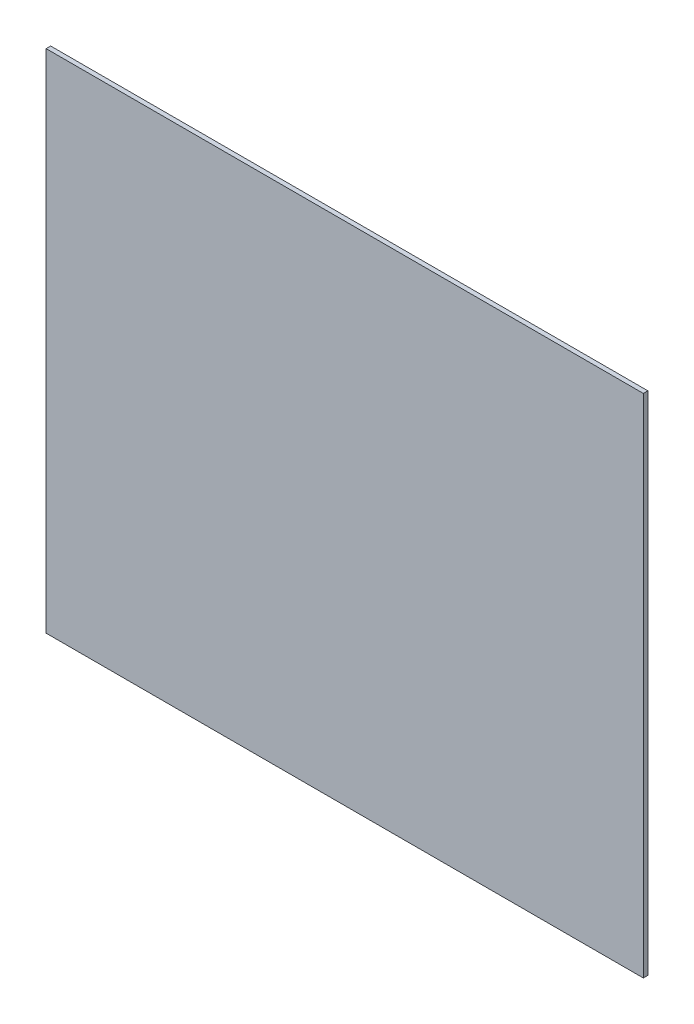
ISO-10303-21;
HEADER;
FILE_DESCRIPTION(('STEP AP214'),'2;1');
FILE_NAME('part.step','',(''),(''),'','','');
FILE_SCHEMA(('AUTOMOTIVE_DESIGN { 1 0 10303 214 1 1 1 1 }'));
ENDSEC;
DATA;
#1=APPLICATION_CONTEXT('core data for automotive mechanical design processes');
#2=APPLICATION_PROTOCOL_DEFINITION('international standard','automotive_design',2000,#1);
#3=PRODUCT_CONTEXT('',#1,'mechanical');
#4=PRODUCT('Part','Part','',(#3));
#5=PRODUCT_RELATED_PRODUCT_CATEGORY('part','',(#4));
#6=PRODUCT_DEFINITION_FORMATION('','',#4);
#7=PRODUCT_DEFINITION_CONTEXT('part definition',#1,'design');
#8=PRODUCT_DEFINITION('design','',#6,#7);
#9=PRODUCT_DEFINITION_SHAPE('','',#8);
#10=(LENGTH_UNIT() NAMED_UNIT(*) SI_UNIT(.MILLI.,.METRE.));
#11=(NAMED_UNIT(*) PLANE_ANGLE_UNIT() SI_UNIT($,.RADIAN.));
#12=(NAMED_UNIT(*) SI_UNIT($,.STERADIAN.) SOLID_ANGLE_UNIT());
#13=UNCERTAINTY_MEASURE_WITH_UNIT(LENGTH_MEASURE(1.E-05),#10,'distance_accuracy_value','');
#14=(GEOMETRIC_REPRESENTATION_CONTEXT(3) GLOBAL_UNCERTAINTY_ASSIGNED_CONTEXT((#13)) GLOBAL_UNIT_ASSIGNED_CONTEXT((#10,
#11,#12)) REPRESENTATION_CONTEXT('',''));
#15=CARTESIAN_POINT('',(0.,0.,0.));
#16=DIRECTION('',(0.,0.,1.));
#17=DIRECTION('',(1.,0.,0.));
#18=AXIS2_PLACEMENT_3D('',#15,#16,#17);
#19=CARTESIAN_POINT('',(197.,167.,0.));
#20=DIRECTION('',(0.,0.,1.));
#21=DIRECTION('',(1.,0.,0.));
#22=AXIS2_PLACEMENT_3D('',#19,#20,#21);
#23=PLANE('',#22);
#24=DIRECTION('',(0.,1.,0.));
#25=VECTOR('',#24,1.);
#26=CARTESIAN_POINT('',(0.,334.,0.));
#27=LINE('',#26,#25);
#28=CARTESIAN_POINT('',(0.,334.,0.));
#29=VERTEX_POINT('',#28);
#30=CARTESIAN_POINT('',(0.,0.,0.));
#31=VERTEX_POINT('',#30);
#32=EDGE_CURVE('E78',#29,#31,#27,.F.);
#33=ORIENTED_EDGE('',*,*,#32,.F.);
#34=DIRECTION('',(1.,0.,0.));
#35=VECTOR('',#34,1.);
#36=CARTESIAN_POINT('',(394.,334.,0.));
#37=LINE('',#36,#35);
#38=CARTESIAN_POINT('',(394.,334.,0.));
#39=VERTEX_POINT('',#38);
#40=EDGE_CURVE('E54',#39,#29,#37,.F.);
#41=ORIENTED_EDGE('',*,*,#40,.F.);
#42=DIRECTION('',(0.,1.,0.));
#43=VECTOR('',#42,1.);
#44=CARTESIAN_POINT('',(394.,0.,0.));
#45=LINE('',#44,#43);
#46=CARTESIAN_POINT('',(394.,0.,0.));
#47=VERTEX_POINT('',#46);
#48=EDGE_CURVE('E56',#47,#39,#45,.T.);
#49=ORIENTED_EDGE('',*,*,#48,.F.);
#50=DIRECTION('',(1.,0.,0.));
#51=VECTOR('',#50,1.);
#52=CARTESIAN_POINT('',(0.,0.,0.));
#53=LINE('',#52,#51);
#54=EDGE_CURVE('E19',#31,#47,#53,.T.);
#55=ORIENTED_EDGE('',*,*,#54,.F.);
#56=EDGE_LOOP('',(#33,#41,#49,#55));
#57=FACE_BOUND('',#56,.T.);
#58=ADVANCED_FACE('F16',(#57),#23,.F.);
#59=CARTESIAN_POINT('',(0.,0.,0.));
#60=DIRECTION('',(0.,-1.,0.));
#61=DIRECTION('',(0.,0.,-1.));
#62=AXIS2_PLACEMENT_3D('',#59,#60,#61);
#63=PLANE('',#62);
#64=DIRECTION('',(1.,0.,0.));
#65=VECTOR('',#64,1.);
#66=CARTESIAN_POINT('',(197.,0.,3.));
#67=LINE('',#66,#65);
#68=CARTESIAN_POINT('',(0.,0.,3.));
#69=VERTEX_POINT('',#68);
#70=CARTESIAN_POINT('',(394.,0.,3.));
#71=VERTEX_POINT('',#70);
#72=EDGE_CURVE('E82',#69,#71,#67,.T.);
#73=ORIENTED_EDGE('',*,*,#72,.F.);
#74=DIRECTION('',(0.,0.,1.));
#75=VECTOR('',#74,1.);
#76=CARTESIAN_POINT('',(0.,0.,0.));
#77=LINE('',#76,#75);
#78=EDGE_CURVE('E67',#31,#69,#77,.T.);
#79=ORIENTED_EDGE('',*,*,#78,.F.);
#80=ORIENTED_EDGE('',*,*,#54,.T.);
#81=DIRECTION('',(0.,0.,-1.));
#82=VECTOR('',#81,1.);
#83=CARTESIAN_POINT('',(394.,0.,0.));
#84=LINE('',#83,#82);
#85=EDGE_CURVE('E62',#71,#47,#84,.T.);
#86=ORIENTED_EDGE('',*,*,#85,.F.);
#87=EDGE_LOOP('',(#73,#79,#80,#86));
#88=FACE_BOUND('',#87,.T.);
#89=ADVANCED_FACE('F64',(#88),#63,.T.);
#90=CARTESIAN_POINT('',(394.,0.,0.));
#91=DIRECTION('',(1.,0.,0.));
#92=DIRECTION('',(0.,0.,-1.));
#93=AXIS2_PLACEMENT_3D('',#90,#91,#92);
#94=PLANE('',#93);
#95=DIRECTION('',(0.,1.,0.));
#96=VECTOR('',#95,1.);
#97=CARTESIAN_POINT('',(394.,167.,3.));
#98=LINE('',#97,#96);
#99=CARTESIAN_POINT('',(394.,334.,3.));
#100=VERTEX_POINT('',#99);
#101=EDGE_CURVE('E71',#71,#100,#98,.T.);
#102=ORIENTED_EDGE('',*,*,#101,.F.);
#103=ORIENTED_EDGE('',*,*,#85,.T.);
#104=ORIENTED_EDGE('',*,*,#48,.T.);
#105=DIRECTION('',(0.,0.,1.));
#106=VECTOR('',#105,1.);
#107=CARTESIAN_POINT('',(394.,334.,0.));
#108=LINE('',#107,#106);
#109=EDGE_CURVE('E74',#100,#39,#108,.F.);
#110=ORIENTED_EDGE('',*,*,#109,.F.);
#111=EDGE_LOOP('',(#102,#103,#104,#110));
#112=FACE_BOUND('',#111,.T.);
#113=ADVANCED_FACE('F69',(#112),#94,.T.);
#114=CARTESIAN_POINT('',(394.,334.,0.));
#115=DIRECTION('',(0.,1.,0.));
#116=DIRECTION('',(0.,0.,1.));
#117=AXIS2_PLACEMENT_3D('',#114,#115,#116);
#118=PLANE('',#117);
#119=DIRECTION('',(1.,0.,0.));
#120=VECTOR('',#119,1.);
#121=CARTESIAN_POINT('',(197.,334.,3.));
#122=LINE('',#121,#120);
#123=CARTESIAN_POINT('',(0.,334.,3.));
#124=VERTEX_POINT('',#123);
#125=EDGE_CURVE('E25',#100,#124,#122,.F.);
#126=ORIENTED_EDGE('',*,*,#125,.F.);
#127=ORIENTED_EDGE('',*,*,#109,.T.);
#128=ORIENTED_EDGE('',*,*,#40,.T.);
#129=DIRECTION('',(0.,0.,1.));
#130=VECTOR('',#129,1.);
#131=CARTESIAN_POINT('',(0.,334.,0.));
#132=LINE('',#131,#130);
#133=EDGE_CURVE('E34',#124,#29,#132,.F.);
#134=ORIENTED_EDGE('',*,*,#133,.F.);
#135=EDGE_LOOP('',(#126,#127,#128,#134));
#136=FACE_BOUND('',#135,.T.);
#137=ADVANCED_FACE('F88',(#136),#118,.T.);
#138=CARTESIAN_POINT('',(0.,334.,0.));
#139=DIRECTION('',(-1.,0.,0.));
#140=DIRECTION('',(0.,0.,1.));
#141=AXIS2_PLACEMENT_3D('',#138,#139,#140);
#142=PLANE('',#141);
#143=DIRECTION('',(0.,1.,0.));
#144=VECTOR('',#143,1.);
#145=CARTESIAN_POINT('',(0.,167.,3.));
#146=LINE('',#145,#144);
#147=EDGE_CURVE('E11',#124,#69,#146,.F.);
#148=ORIENTED_EDGE('',*,*,#147,.F.);
#149=ORIENTED_EDGE('',*,*,#133,.T.);
#150=ORIENTED_EDGE('',*,*,#32,.T.);
#151=ORIENTED_EDGE('',*,*,#78,.T.);
#152=EDGE_LOOP('',(#148,#149,#150,#151));
#153=FACE_BOUND('',#152,.T.);
#154=ADVANCED_FACE('F90',(#153),#142,.T.);
#155=CARTESIAN_POINT('',(197.,167.,3.));
#156=DIRECTION('',(0.,0.,1.));
#157=DIRECTION('',(1.,0.,0.));
#158=AXIS2_PLACEMENT_3D('',#155,#156,#157);
#159=PLANE('',#158);
#160=ORIENTED_EDGE('',*,*,#125,.T.);
#161=ORIENTED_EDGE('',*,*,#147,.T.);
#162=ORIENTED_EDGE('',*,*,#72,.T.);
#163=ORIENTED_EDGE('',*,*,#101,.T.);
#164=EDGE_LOOP('',(#160,#161,#162,#163));
#165=FACE_BOUND('',#164,.T.);
#166=ADVANCED_FACE('F87',(#165),#159,.T.);
#167=CLOSED_SHELL('',(#58,#89,#113,#137,#154,#166));
#168=MANIFOLD_SOLID_BREP('B1',#167);
#169=ADVANCED_BREP_SHAPE_REPRESENTATION('',(#18,#168),#14);
#170=SHAPE_DEFINITION_REPRESENTATION(#9,#169);
ENDSEC;
END-ISO-10303-21;
